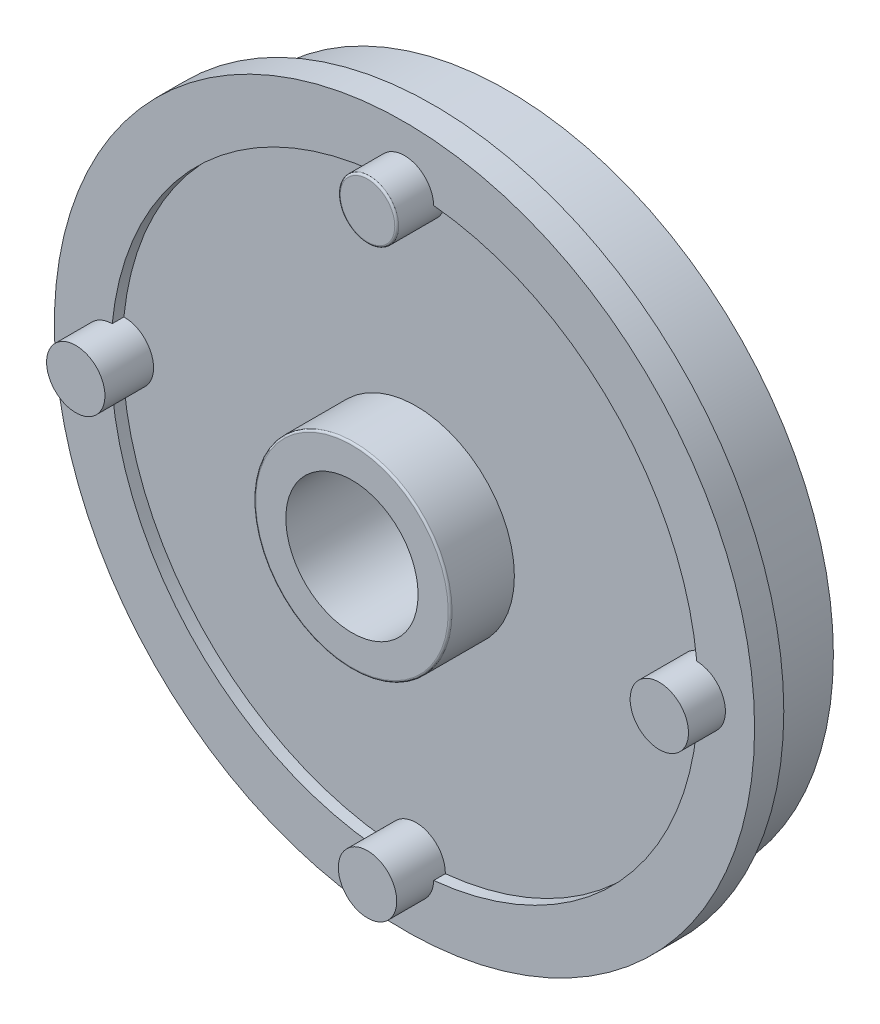
ISO-10303-21;
HEADER;
FILE_DESCRIPTION(('STEP AP214'),'2;1');
FILE_NAME('part.step','',(''),(''),'','','');
FILE_SCHEMA(('AUTOMOTIVE_DESIGN { 1 0 10303 214 1 1 1 1 }'));
ENDSEC;
DATA;
#1=APPLICATION_CONTEXT('core data for automotive mechanical design processes');
#2=APPLICATION_PROTOCOL_DEFINITION('international standard','automotive_design',2000,#1);
#3=PRODUCT_CONTEXT('',#1,'mechanical');
#4=PRODUCT('Part','Part','',(#3));
#5=PRODUCT_RELATED_PRODUCT_CATEGORY('part','',(#4));
#6=PRODUCT_DEFINITION_FORMATION('','',#4);
#7=PRODUCT_DEFINITION_CONTEXT('part definition',#1,'design');
#8=PRODUCT_DEFINITION('design','',#6,#7);
#9=PRODUCT_DEFINITION_SHAPE('','',#8);
#10=(LENGTH_UNIT() NAMED_UNIT(*) SI_UNIT(.MILLI.,.METRE.));
#11=(NAMED_UNIT(*) PLANE_ANGLE_UNIT() SI_UNIT($,.RADIAN.));
#12=(NAMED_UNIT(*) SI_UNIT($,.STERADIAN.) SOLID_ANGLE_UNIT());
#13=UNCERTAINTY_MEASURE_WITH_UNIT(LENGTH_MEASURE(1.E-05),#10,'distance_accuracy_value','');
#14=(GEOMETRIC_REPRESENTATION_CONTEXT(3) GLOBAL_UNCERTAINTY_ASSIGNED_CONTEXT((#13)) GLOBAL_UNIT_ASSIGNED_CONTEXT((#10,
#11,#12)) REPRESENTATION_CONTEXT('',''));
#15=CARTESIAN_POINT('',(0.,0.,0.));
#16=DIRECTION('',(0.,0.,1.));
#17=DIRECTION('',(1.,0.,0.));
#18=AXIS2_PLACEMENT_3D('',#15,#16,#17);
#19=CARTESIAN_POINT('',(0.,0.,4.7));
#20=DIRECTION('',(0.,0.,1.));
#21=DIRECTION('',(1.,0.,0.));
#22=AXIS2_PLACEMENT_3D('',#19,#20,#21);
#23=CYLINDRICAL_SURFACE('',#22,15.1);
#24=DIRECTION('',(0.,0.,-1.));
#25=VECTOR('',#24,1.);
#26=CARTESIAN_POINT('',(15.0253333333333,1.49978605881729,5.95));
#27=LINE('',#26,#25);
#28=CARTESIAN_POINT('',(15.0253333333333,1.49978605881729,5.3));
#29=VERTEX_POINT('',#28);
#30=CARTESIAN_POINT('',(15.0253333333333,1.49978605881729,4.7));
#31=VERTEX_POINT('',#30);
#32=EDGE_CURVE('E51',#29,#31,#27,.T.);
#33=ORIENTED_EDGE('',*,*,#32,.F.);
#34=CARTESIAN_POINT('',(0.,0.,5.3));
#35=DIRECTION('',(0.,0.,1.));
#36=DIRECTION('',(1.,0.,0.));
#37=AXIS2_PLACEMENT_3D('',#34,#35,#36);
#38=CIRCLE('',#37,15.1);
#39=CARTESIAN_POINT('',(1.49978605881713,15.0253333333333,5.3));
#40=VERTEX_POINT('',#39);
#41=EDGE_CURVE('E129',#29,#40,#38,.T.);
#42=ORIENTED_EDGE('',*,*,#41,.T.);
#43=DIRECTION('',(0.,0.,-1.));
#44=VECTOR('',#43,1.);
#45=CARTESIAN_POINT('',(1.49978605881713,15.0253333333333,5.95));
#46=LINE('',#45,#44);
#47=CARTESIAN_POINT('',(1.49978605881713,15.0253333333333,4.7));
#48=VERTEX_POINT('',#47);
#49=EDGE_CURVE('E210',#48,#40,#46,.F.);
#50=ORIENTED_EDGE('',*,*,#49,.F.);
#51=CARTESIAN_POINT('',(0.,0.,4.7));
#52=DIRECTION('',(0.,0.,1.));
#53=DIRECTION('',(1.,0.,0.));
#54=AXIS2_PLACEMENT_3D('',#51,#52,#53);
#55=CIRCLE('',#54,15.1);
#56=EDGE_CURVE('E116',#31,#48,#55,.T.);
#57=ORIENTED_EDGE('',*,*,#56,.F.);
#58=EDGE_LOOP('',(#33,#42,#50,#57));
#59=FACE_BOUND('',#58,.T.);
#60=ADVANCED_FACE('F36',(#59),#23,.F.);
#61=DIRECTION('',(0.,0.,-1.));
#62=VECTOR('',#61,1.);
#63=CARTESIAN_POINT('',(15.0253333333333,-1.49978605881697,5.95));
#64=LINE('',#63,#62);
#65=CARTESIAN_POINT('',(15.0253333333333,-1.49978605881697,4.7));
#66=VERTEX_POINT('',#65);
#67=CARTESIAN_POINT('',(15.0253333333333,-1.49978605881698,5.3));
#68=VERTEX_POINT('',#67);
#69=EDGE_CURVE('E99',#66,#68,#64,.F.);
#70=ORIENTED_EDGE('',*,*,#69,.F.);
#71=CARTESIAN_POINT('',(1.49978605881714,-15.0253333333333,4.7));
#72=VERTEX_POINT('',#71);
#73=EDGE_CURVE('E108',#72,#66,#55,.T.);
#74=ORIENTED_EDGE('',*,*,#73,.F.);
#75=DIRECTION('',(0.,0.,-1.));
#76=VECTOR('',#75,1.);
#77=CARTESIAN_POINT('',(1.49978605881713,-15.0253333333333,5.95));
#78=LINE('',#77,#76);
#79=CARTESIAN_POINT('',(1.49978605881714,-15.0253333333333,5.3));
#80=VERTEX_POINT('',#79);
#81=EDGE_CURVE('E58',#80,#72,#78,.T.);
#82=ORIENTED_EDGE('',*,*,#81,.F.);
#83=EDGE_CURVE('E110',#80,#68,#38,.T.);
#84=ORIENTED_EDGE('',*,*,#83,.T.);
#85=EDGE_LOOP('',(#70,#74,#82,#84));
#86=FACE_BOUND('',#85,.T.);
#87=ADVANCED_FACE('F107',(#86),#23,.F.);
#88=DIRECTION('',(0.,0.,-1.));
#89=VECTOR('',#88,1.);
#90=CARTESIAN_POINT('',(-1.49978605881713,-15.0253333333333,5.95));
#91=LINE('',#90,#89);
#92=CARTESIAN_POINT('',(-1.49978605881713,-15.0253333333333,4.7));
#93=VERTEX_POINT('',#92);
#94=CARTESIAN_POINT('',(-1.49978605881714,-15.0253333333333,5.3));
#95=VERTEX_POINT('',#94);
#96=EDGE_CURVE('E192',#93,#95,#91,.F.);
#97=ORIENTED_EDGE('',*,*,#96,.F.);
#98=CARTESIAN_POINT('',(-15.0253333333333,-1.49978605881719,4.7));
#99=VERTEX_POINT('',#98);
#100=EDGE_CURVE('E115',#99,#93,#55,.T.);
#101=ORIENTED_EDGE('',*,*,#100,.F.);
#102=DIRECTION('',(0.,0.,-1.));
#103=VECTOR('',#102,1.);
#104=CARTESIAN_POINT('',(-15.0253333333333,-1.49978605881718,5.95));
#105=LINE('',#104,#103);
#106=CARTESIAN_POINT('',(-15.0253333333333,-1.49978605881719,5.3));
#107=VERTEX_POINT('',#106);
#108=EDGE_CURVE('E190',#107,#99,#105,.T.);
#109=ORIENTED_EDGE('',*,*,#108,.F.);
#110=EDGE_CURVE('E128',#107,#95,#38,.T.);
#111=ORIENTED_EDGE('',*,*,#110,.T.);
#112=EDGE_LOOP('',(#97,#101,#109,#111));
#113=FACE_BOUND('',#112,.T.);
#114=ADVANCED_FACE('F188',(#113),#23,.F.);
#115=DIRECTION('',(0.,0.,-1.));
#116=VECTOR('',#115,1.);
#117=CARTESIAN_POINT('',(-15.0253333333333,1.49978605881708,5.95));
#118=LINE('',#117,#116);
#119=CARTESIAN_POINT('',(-15.0253333333333,1.49978605881708,4.7));
#120=VERTEX_POINT('',#119);
#121=CARTESIAN_POINT('',(-15.0253333333333,1.49978605881709,5.3));
#122=VERTEX_POINT('',#121);
#123=EDGE_CURVE('E207',#120,#122,#118,.F.);
#124=ORIENTED_EDGE('',*,*,#123,.F.);
#125=CARTESIAN_POINT('',(-1.49978605881714,15.0253333333333,4.7));
#126=VERTEX_POINT('',#125);
#127=EDGE_CURVE('E118',#126,#120,#55,.T.);
#128=ORIENTED_EDGE('',*,*,#127,.F.);
#129=DIRECTION('',(0.,0.,-1.));
#130=VECTOR('',#129,1.);
#131=CARTESIAN_POINT('',(-1.49978605881713,15.0253333333333,5.95));
#132=LINE('',#131,#130);
#133=CARTESIAN_POINT('',(-1.49978605881714,15.0253333333333,5.3));
#134=VERTEX_POINT('',#133);
#135=EDGE_CURVE('E216',#134,#126,#132,.T.);
#136=ORIENTED_EDGE('',*,*,#135,.F.);
#137=EDGE_CURVE('E119',#134,#122,#38,.T.);
#138=ORIENTED_EDGE('',*,*,#137,.T.);
#139=EDGE_LOOP('',(#124,#128,#136,#138));
#140=FACE_BOUND('',#139,.T.);
#141=ADVANCED_FACE('F240',(#140),#23,.F.);
#142=CARTESIAN_POINT('',(0.,0.,8.));
#143=DIRECTION('',(0.,0.,-1.));
#144=DIRECTION('',(-1.,0.,0.));
#145=AXIS2_PLACEMENT_3D('',#142,#143,#144);
#146=CYLINDRICAL_SURFACE('',#145,2.65);
#147=CARTESIAN_POINT('',(0.,0.,-0.5));
#148=DIRECTION('',(0.,0.,-1.));
#149=DIRECTION('',(-1.,0.,0.));
#150=AXIS2_PLACEMENT_3D('',#147,#148,#149);
#151=CIRCLE('',#150,2.65);
#152=CARTESIAN_POINT('',(-2.65,0.,-0.5));
#153=VERTEX_POINT('',#152);
#154=EDGE_CURVE('E163',#153,#153,#151,.T.);
#155=ORIENTED_EDGE('',*,*,#154,.T.);
#156=EDGE_LOOP('',(#155));
#157=FACE_BOUND('',#156,.T.);
#158=CARTESIAN_POINT('',(0.,0.,1.));
#159=DIRECTION('',(0.,0.,1.));
#160=DIRECTION('',(1.,0.,0.));
#161=AXIS2_PLACEMENT_3D('',#158,#159,#160);
#162=CIRCLE('',#161,2.65);
#163=CARTESIAN_POINT('',(2.65,0.,1.));
#164=VERTEX_POINT('',#163);
#165=EDGE_CURVE('E160',#164,#164,#162,.F.);
#166=ORIENTED_EDGE('',*,*,#165,.F.);
#167=EDGE_LOOP('',(#166));
#168=FACE_BOUND('',#167,.T.);
#169=ADVANCED_FACE('F265',(#157,#168),#146,.F.);
#170=CARTESIAN_POINT('',(0.,0.,3.8));
#171=DIRECTION('',(0.,0.,-1.));
#172=DIRECTION('',(-1.,0.,0.));
#173=AXIS2_PLACEMENT_3D('',#170,#171,#172);
#174=CYLINDRICAL_SURFACE('',#173,16.75);
#175=CARTESIAN_POINT('',(0.,0.,3.8));
#176=DIRECTION('',(0.,0.,1.));
#177=DIRECTION('',(1.,0.,0.));
#178=AXIS2_PLACEMENT_3D('',#175,#176,#177);
#179=CIRCLE('',#178,16.75);
#180=CARTESIAN_POINT('',(16.75,0.,3.8));
#181=VERTEX_POINT('',#180);
#182=EDGE_CURVE('E154',#181,#181,#179,.T.);
#183=ORIENTED_EDGE('',*,*,#182,.F.);
#184=EDGE_LOOP('',(#183));
#185=FACE_BOUND('',#184,.T.);
#186=CARTESIAN_POINT('',(0.,0.,0.));
#187=DIRECTION('',(0.,0.,1.));
#188=DIRECTION('',(1.,0.,0.));
#189=AXIS2_PLACEMENT_3D('',#186,#187,#188);
#190=CIRCLE('',#189,16.75);
#191=CARTESIAN_POINT('',(16.75,0.,0.));
#192=VERTEX_POINT('',#191);
#193=EDGE_CURVE('E151',#192,#192,#190,.T.);
#194=ORIENTED_EDGE('',*,*,#193,.T.);
#195=EDGE_LOOP('',(#194));
#196=FACE_BOUND('',#195,.T.);
#197=ADVANCED_FACE('F270',(#185,#196),#174,.T.);
#198=CARTESIAN_POINT('',(0.,0.,0.));
#199=DIRECTION('',(0.,0.,1.));
#200=DIRECTION('',(1.,0.,0.));
#201=AXIS2_PLACEMENT_3D('',#198,#199,#200);
#202=PLANE('',#201);
#203=CARTESIAN_POINT('',(0.,0.,0.));
#204=DIRECTION('',(0.,0.,-1.));
#205=DIRECTION('',(-1.,0.,0.));
#206=AXIS2_PLACEMENT_3D('',#203,#204,#205);
#207=CIRCLE('',#206,13.25);
#208=CARTESIAN_POINT('',(-13.25,0.,0.));
#209=VERTEX_POINT('',#208);
#210=EDGE_CURVE('E139',#209,#209,#207,.T.);
#211=ORIENTED_EDGE('',*,*,#210,.F.);
#212=EDGE_LOOP('',(#211));
#213=FACE_BOUND('',#212,.T.);
#214=ORIENTED_EDGE('',*,*,#193,.F.);
#215=EDGE_LOOP('',(#214));
#216=FACE_BOUND('',#215,.T.);
#217=ADVANCED_FACE('F432',(#213,#216),#202,.F.);
#218=CARTESIAN_POINT('',(0.,0.,5.3));
#219=DIRECTION('',(0.,0.,-1.));
#220=DIRECTION('',(-1.,0.,0.));
#221=AXIS2_PLACEMENT_3D('',#218,#219,#220);
#222=CYLINDRICAL_SURFACE('',#221,18.);
#223=CARTESIAN_POINT('',(0.,0.,5.3));
#224=DIRECTION('',(0.,0.,1.));
#225=DIRECTION('',(1.,0.,0.));
#226=AXIS2_PLACEMENT_3D('',#223,#224,#225);
#227=CIRCLE('',#226,18.);
#228=CARTESIAN_POINT('',(18.,0.,5.3));
#229=VERTEX_POINT('',#228);
#230=EDGE_CURVE('E148',#229,#229,#227,.T.);
#231=ORIENTED_EDGE('',*,*,#230,.F.);
#232=EDGE_LOOP('',(#231));
#233=FACE_BOUND('',#232,.T.);
#234=CARTESIAN_POINT('',(0.,0.,3.8));
#235=DIRECTION('',(0.,0.,1.));
#236=DIRECTION('',(1.,0.,0.));
#237=AXIS2_PLACEMENT_3D('',#234,#235,#236);
#238=CIRCLE('',#237,18.);
#239=CARTESIAN_POINT('',(18.,0.,3.8));
#240=VERTEX_POINT('',#239);
#241=EDGE_CURVE('E145',#240,#240,#238,.T.);
#242=ORIENTED_EDGE('',*,*,#241,.T.);
#243=EDGE_LOOP('',(#242));
#244=FACE_BOUND('',#243,.T.);
#245=ADVANCED_FACE('F437',(#233,#244),#222,.T.);
#246=CARTESIAN_POINT('',(0.,0.,5.3));
#247=DIRECTION('',(0.,0.,1.));
#248=DIRECTION('',(1.,0.,0.));
#249=AXIS2_PLACEMENT_3D('',#246,#247,#248);
#250=PLANE('',#249);
#251=ORIENTED_EDGE('',*,*,#41,.F.);
#252=CARTESIAN_POINT('',(15.,1.57116660247941E-13,5.3));
#253=DIRECTION('',(0.,0.,1.));
#254=DIRECTION('',(1.,0.,0.));
#255=AXIS2_PLACEMENT_3D('',#252,#253,#254);
#256=CIRCLE('',#255,1.5);
#257=EDGE_CURVE('E111',#29,#68,#256,.F.);
#258=ORIENTED_EDGE('',*,*,#257,.T.);
#259=ORIENTED_EDGE('',*,*,#83,.F.);
#260=CARTESIAN_POINT('',(0.,-15.,5.3));
#261=DIRECTION('',(0.,0.,1.));
#262=DIRECTION('',(1.,0.,0.));
#263=AXIS2_PLACEMENT_3D('',#260,#261,#262);
#264=CIRCLE('',#263,1.5);
#265=EDGE_CURVE('E194',#80,#95,#264,.F.);
#266=ORIENTED_EDGE('',*,*,#265,.T.);
#267=ORIENTED_EDGE('',*,*,#110,.F.);
#268=CARTESIAN_POINT('',(-15.,0.,5.3));
#269=DIRECTION('',(0.,0.,1.));
#270=DIRECTION('',(1.,0.,0.));
#271=AXIS2_PLACEMENT_3D('',#268,#269,#270);
#272=CIRCLE('',#271,1.5);
#273=EDGE_CURVE('E204',#107,#122,#272,.F.);
#274=ORIENTED_EDGE('',*,*,#273,.T.);
#275=ORIENTED_EDGE('',*,*,#137,.F.);
#276=CARTESIAN_POINT('',(0.,15.,5.3));
#277=DIRECTION('',(0.,0.,1.));
#278=DIRECTION('',(1.,0.,0.));
#279=AXIS2_PLACEMENT_3D('',#276,#277,#278);
#280=CIRCLE('',#279,1.5);
#281=EDGE_CURVE('E213',#134,#40,#280,.F.);
#282=ORIENTED_EDGE('',*,*,#281,.T.);
#283=EDGE_LOOP('',(#251,#258,#259,#266,#267,#274,#275,#282));
#284=FACE_BOUND('',#283,.T.);
#285=ORIENTED_EDGE('',*,*,#230,.T.);
#286=EDGE_LOOP('',(#285));
#287=FACE_BOUND('',#286,.T.);
#288=ADVANCED_FACE('F237',(#284,#287),#250,.T.);
#289=CARTESIAN_POINT('',(0.,0.,3.8));
#290=DIRECTION('',(0.,0.,1.));
#291=DIRECTION('',(1.,0.,0.));
#292=AXIS2_PLACEMENT_3D('',#289,#290,#291);
#293=PLANE('',#292);
#294=ORIENTED_EDGE('',*,*,#182,.T.);
#295=EDGE_LOOP('',(#294));
#296=FACE_BOUND('',#295,.T.);
#297=ORIENTED_EDGE('',*,*,#241,.F.);
#298=EDGE_LOOP('',(#297));
#299=FACE_BOUND('',#298,.T.);
#300=ADVANCED_FACE('F424',(#296,#299),#293,.F.);
#301=CARTESIAN_POINT('',(0.,0.,4.));
#302=DIRECTION('',(0.,0.,-1.));
#303=DIRECTION('',(-1.,0.,0.));
#304=AXIS2_PLACEMENT_3D('',#301,#302,#303);
#305=CYLINDRICAL_SURFACE('',#304,13.25);
#306=CARTESIAN_POINT('',(0.,0.,4.));
#307=DIRECTION('',(0.,0.,-1.));
#308=DIRECTION('',(-1.,0.,0.));
#309=AXIS2_PLACEMENT_3D('',#306,#307,#308);
#310=CIRCLE('',#309,13.25);
#311=CARTESIAN_POINT('',(-13.25,0.,4.));
#312=VERTEX_POINT('',#311);
#313=EDGE_CURVE('E142',#312,#312,#310,.T.);
#314=ORIENTED_EDGE('',*,*,#313,.F.);
#315=EDGE_LOOP('',(#314));
#316=FACE_BOUND('',#315,.T.);
#317=ORIENTED_EDGE('',*,*,#210,.T.);
#318=EDGE_LOOP('',(#317));
#319=FACE_BOUND('',#318,.T.);
#320=ADVANCED_FACE('F414',(#316,#319),#305,.F.);
#321=CARTESIAN_POINT('',(0.,0.,4.));
#322=DIRECTION('',(0.,0.,-1.));
#323=DIRECTION('',(-1.,0.,0.));
#324=AXIS2_PLACEMENT_3D('',#321,#322,#323);
#325=PLANE('',#324);
#326=CARTESIAN_POINT('',(0.,0.,4.));
#327=DIRECTION('',(0.,0.,-1.));
#328=DIRECTION('',(-1.,0.,0.));
#329=AXIS2_PLACEMENT_3D('',#326,#327,#328);
#330=CIRCLE('',#329,5.);
#331=CARTESIAN_POINT('',(-5.,0.,4.));
#332=VERTEX_POINT('',#331);
#333=EDGE_CURVE('E133',#332,#332,#330,.T.);
#334=ORIENTED_EDGE('',*,*,#333,.F.);
#335=EDGE_LOOP('',(#334));
#336=FACE_BOUND('',#335,.T.);
#337=ORIENTED_EDGE('',*,*,#313,.T.);
#338=EDGE_LOOP('',(#337));
#339=FACE_BOUND('',#338,.T.);
#340=ADVANCED_FACE('F404',(#336,#339),#325,.T.);
#341=CARTESIAN_POINT('',(0.,0.,-2.5));
#342=DIRECTION('',(0.,0.,1.));
#343=DIRECTION('',(1.,0.,0.));
#344=AXIS2_PLACEMENT_3D('',#341,#342,#343);
#345=CYLINDRICAL_SURFACE('',#344,5.);
#346=CARTESIAN_POINT('',(0.,0.,-2.5));
#347=DIRECTION('',(0.,0.,-1.));
#348=DIRECTION('',(-1.,0.,0.));
#349=AXIS2_PLACEMENT_3D('',#346,#347,#348);
#350=CIRCLE('',#349,5.);
#351=CARTESIAN_POINT('',(-5.,0.,-2.5));
#352=VERTEX_POINT('',#351);
#353=EDGE_CURVE('E136',#352,#352,#350,.T.);
#354=ORIENTED_EDGE('',*,*,#353,.F.);
#355=EDGE_LOOP('',(#354));
#356=FACE_BOUND('',#355,.T.);
#357=ORIENTED_EDGE('',*,*,#333,.T.);
#358=EDGE_LOOP('',(#357));
#359=FACE_BOUND('',#358,.T.);
#360=ADVANCED_FACE('F394',(#356,#359),#345,.T.);
#361=CARTESIAN_POINT('',(0.,0.,-2.5));
#362=DIRECTION('',(0.,0.,-1.));
#363=DIRECTION('',(-1.,0.,0.));
#364=AXIS2_PLACEMENT_3D('',#361,#362,#363);
#365=PLANE('',#364);
#366=CARTESIAN_POINT('',(0.,0.,-2.5));
#367=DIRECTION('',(0.,0.,-1.));
#368=DIRECTION('',(-1.,0.,0.));
#369=AXIS2_PLACEMENT_3D('',#366,#367,#368);
#370=CIRCLE('',#369,4.);
#371=CARTESIAN_POINT('',(-4.,0.,-2.5));
#372=VERTEX_POINT('',#371);
#373=EDGE_CURVE('E123',#372,#372,#370,.T.);
#374=ORIENTED_EDGE('',*,*,#373,.F.);
#375=EDGE_LOOP('',(#374));
#376=FACE_BOUND('',#375,.T.);
#377=ORIENTED_EDGE('',*,*,#353,.T.);
#378=EDGE_LOOP('',(#377));
#379=FACE_BOUND('',#378,.T.);
#380=ADVANCED_FACE('F384',(#376,#379),#365,.T.);
#381=CARTESIAN_POINT('',(0.,0.,-0.5));
#382=DIRECTION('',(0.,0.,-1.));
#383=DIRECTION('',(-1.,0.,0.));
#384=AXIS2_PLACEMENT_3D('',#381,#382,#383);
#385=CYLINDRICAL_SURFACE('',#384,4.);
#386=CARTESIAN_POINT('',(0.,0.,-0.5));
#387=DIRECTION('',(0.,0.,-1.));
#388=DIRECTION('',(-1.,0.,0.));
#389=AXIS2_PLACEMENT_3D('',#386,#387,#388);
#390=CIRCLE('',#389,4.);
#391=CARTESIAN_POINT('',(-4.,0.,-0.5));
#392=VERTEX_POINT('',#391);
#393=EDGE_CURVE('E130',#392,#392,#390,.T.);
#394=ORIENTED_EDGE('',*,*,#393,.F.);
#395=EDGE_LOOP('',(#394));
#396=FACE_BOUND('',#395,.T.);
#397=ORIENTED_EDGE('',*,*,#373,.T.);
#398=EDGE_LOOP('',(#397));
#399=FACE_BOUND('',#398,.T.);
#400=ADVANCED_FACE('F375',(#396,#399),#385,.F.);
#401=CARTESIAN_POINT('',(0.,0.,-0.5));
#402=DIRECTION('',(0.,0.,-1.));
#403=DIRECTION('',(-1.,0.,0.));
#404=AXIS2_PLACEMENT_3D('',#401,#402,#403);
#405=PLANE('',#404);
#406=ORIENTED_EDGE('',*,*,#154,.F.);
#407=EDGE_LOOP('',(#406));
#408=FACE_BOUND('',#407,.T.);
#409=ORIENTED_EDGE('',*,*,#393,.T.);
#410=EDGE_LOOP('',(#409));
#411=FACE_BOUND('',#410,.T.);
#412=ADVANCED_FACE('F370',(#408,#411),#405,.T.);
#413=CARTESIAN_POINT('',(0.,0.,4.7));
#414=DIRECTION('',(0.,0.,1.));
#415=DIRECTION('',(1.,0.,0.));
#416=AXIS2_PLACEMENT_3D('',#413,#414,#415);
#417=PLANE('',#416);
#418=CARTESIAN_POINT('',(0.,0.,4.7));
#419=DIRECTION('',(0.,0.,1.));
#420=DIRECTION('',(1.,0.,0.));
#421=AXIS2_PLACEMENT_3D('',#418,#419,#420);
#422=CIRCLE('',#421,5.05);
#423=CARTESIAN_POINT('',(5.05,0.,4.7));
#424=VERTEX_POINT('',#423);
#425=EDGE_CURVE('E124',#424,#424,#422,.T.);
#426=ORIENTED_EDGE('',*,*,#425,.F.);
#427=EDGE_LOOP('',(#426));
#428=FACE_BOUND('',#427,.T.);
#429=ORIENTED_EDGE('',*,*,#73,.T.);
#430=CARTESIAN_POINT('',(15.,1.57116660247941E-13,4.7));
#431=DIRECTION('',(0.,0.,1.));
#432=DIRECTION('',(1.,0.,0.));
#433=AXIS2_PLACEMENT_3D('',#430,#431,#432);
#434=CIRCLE('',#433,1.5);
#435=EDGE_CURVE('E11',#66,#31,#434,.F.);
#436=ORIENTED_EDGE('',*,*,#435,.T.);
#437=ORIENTED_EDGE('',*,*,#56,.T.);
#438=CARTESIAN_POINT('',(0.,15.,4.7));
#439=DIRECTION('',(0.,0.,1.));
#440=DIRECTION('',(1.,0.,0.));
#441=AXIS2_PLACEMENT_3D('',#438,#439,#440);
#442=CIRCLE('',#441,1.5);
#443=EDGE_CURVE('E157',#48,#126,#442,.F.);
#444=ORIENTED_EDGE('',*,*,#443,.T.);
#445=ORIENTED_EDGE('',*,*,#127,.T.);
#446=CARTESIAN_POINT('',(-15.,0.,4.7));
#447=DIRECTION('',(0.,0.,1.));
#448=DIRECTION('',(1.,0.,0.));
#449=AXIS2_PLACEMENT_3D('',#446,#447,#448);
#450=CIRCLE('',#449,1.5);
#451=EDGE_CURVE('E179',#120,#99,#450,.F.);
#452=ORIENTED_EDGE('',*,*,#451,.T.);
#453=ORIENTED_EDGE('',*,*,#100,.T.);
#454=CARTESIAN_POINT('',(0.,-15.,4.7));
#455=DIRECTION('',(0.,0.,1.));
#456=DIRECTION('',(1.,0.,0.));
#457=AXIS2_PLACEMENT_3D('',#454,#455,#456);
#458=CIRCLE('',#457,1.5);
#459=EDGE_CURVE('E44',#93,#72,#458,.F.);
#460=ORIENTED_EDGE('',*,*,#459,.T.);
#461=EDGE_LOOP('',(#429,#436,#437,#444,#445,#452,#453,#460));
#462=FACE_BOUND('',#461,.T.);
#463=ADVANCED_FACE('F113',(#428,#462),#417,.T.);
#464=CARTESIAN_POINT('',(0.,0.,8.));
#465=DIRECTION('',(0.,0.,-1.));
#466=DIRECTION('',(-1.,0.,0.));
#467=AXIS2_PLACEMENT_3D('',#464,#465,#466);
#468=CYLINDRICAL_SURFACE('',#467,5.05);
#469=CARTESIAN_POINT('',(0.,0.,7.9));
#470=DIRECTION('',(0.,0.,1.));
#471=DIRECTION('',(1.,0.,0.));
#472=AXIS2_PLACEMENT_3D('',#469,#470,#471);
#473=CIRCLE('',#472,5.05);
#474=CARTESIAN_POINT('',(5.05,0.,7.9));
#475=VERTEX_POINT('',#474);
#476=EDGE_CURVE('E176',#475,#475,#473,.F.);
#477=ORIENTED_EDGE('',*,*,#476,.T.);
#478=EDGE_LOOP('',(#477));
#479=FACE_BOUND('',#478,.T.);
#480=ORIENTED_EDGE('',*,*,#425,.T.);
#481=EDGE_LOOP('',(#480));
#482=FACE_BOUND('',#481,.T.);
#483=ADVANCED_FACE('F303',(#479,#482),#468,.T.);
#484=CARTESIAN_POINT('',(0.,0.,8.));
#485=DIRECTION('',(0.,0.,1.));
#486=DIRECTION('',(1.,0.,0.));
#487=AXIS2_PLACEMENT_3D('',#484,#485,#486);
#488=PLANE('',#487);
#489=CARTESIAN_POINT('',(0.,0.,8.));
#490=DIRECTION('',(0.,0.,1.));
#491=DIRECTION('',(1.,0.,0.));
#492=AXIS2_PLACEMENT_3D('',#489,#490,#491);
#493=CIRCLE('',#492,4.95);
#494=CARTESIAN_POINT('',(4.95,0.,8.));
#495=VERTEX_POINT('',#494);
#496=EDGE_CURVE('E173',#495,#495,#493,.T.);
#497=ORIENTED_EDGE('',*,*,#496,.T.);
#498=EDGE_LOOP('',(#497));
#499=FACE_BOUND('',#498,.T.);
#500=CARTESIAN_POINT('',(0.,0.,8.));
#501=DIRECTION('',(0.,0.,1.));
#502=DIRECTION('',(1.,0.,0.));
#503=AXIS2_PLACEMENT_3D('',#500,#501,#502);
#504=CIRCLE('',#503,3.4);
#505=CARTESIAN_POINT('',(3.4,0.,8.));
#506=VERTEX_POINT('',#505);
#507=EDGE_CURVE('E218',#506,#506,#504,.T.);
#508=ORIENTED_EDGE('',*,*,#507,.F.);
#509=EDGE_LOOP('',(#508));
#510=FACE_BOUND('',#509,.T.);
#511=ADVANCED_FACE('F297',(#499,#510),#488,.T.);
#512=CARTESIAN_POINT('',(0.,0.,1.));
#513=DIRECTION('',(0.,0.,1.));
#514=DIRECTION('',(1.,0.,0.));
#515=AXIS2_PLACEMENT_3D('',#512,#513,#514);
#516=PLANE('',#515);
#517=CARTESIAN_POINT('',(0.,0.,1.));
#518=DIRECTION('',(0.,0.,1.));
#519=DIRECTION('',(1.,0.,0.));
#520=AXIS2_PLACEMENT_3D('',#517,#518,#519);
#521=CIRCLE('',#520,3.4);
#522=CARTESIAN_POINT('',(3.4,0.,1.));
#523=VERTEX_POINT('',#522);
#524=EDGE_CURVE('E164',#523,#523,#521,.T.);
#525=ORIENTED_EDGE('',*,*,#524,.T.);
#526=EDGE_LOOP('',(#525));
#527=FACE_BOUND('',#526,.T.);
#528=ORIENTED_EDGE('',*,*,#165,.T.);
#529=EDGE_LOOP('',(#528));
#530=FACE_BOUND('',#529,.T.);
#531=ADVANCED_FACE('F302',(#527,#530),#516,.T.);
#532=CARTESIAN_POINT('',(0.,0.,1.));
#533=DIRECTION('',(0.,0.,1.));
#534=DIRECTION('',(1.,0.,0.));
#535=AXIS2_PLACEMENT_3D('',#532,#533,#534);
#536=CYLINDRICAL_SURFACE('',#535,3.4);
#537=ORIENTED_EDGE('',*,*,#524,.F.);
#538=EDGE_LOOP('',(#537));
#539=FACE_BOUND('',#538,.T.);
#540=ORIENTED_EDGE('',*,*,#507,.T.);
#541=EDGE_LOOP('',(#540));
#542=FACE_BOUND('',#541,.T.);
#543=ADVANCED_FACE('F341',(#539,#542),#536,.F.);
#544=CARTESIAN_POINT('',(0.,15.,7.2));
#545=DIRECTION('',(0.,0.,-1.));
#546=DIRECTION('',(-1.,0.,0.));
#547=AXIS2_PLACEMENT_3D('',#544,#545,#546);
#548=CYLINDRICAL_SURFACE('',#547,1.5);
#549=CARTESIAN_POINT('',(0.,15.,7.1));
#550=DIRECTION('',(0.,0.,1.));
#551=DIRECTION('',(1.,0.,0.));
#552=AXIS2_PLACEMENT_3D('',#549,#550,#551);
#553=CIRCLE('',#552,1.5);
#554=CARTESIAN_POINT('',(1.5,15.,7.1));
#555=VERTEX_POINT('',#554);
#556=EDGE_CURVE('E170',#555,#555,#553,.F.);
#557=ORIENTED_EDGE('',*,*,#556,.T.);
#558=EDGE_LOOP('',(#557));
#559=FACE_BOUND('',#558,.T.);
#560=ORIENTED_EDGE('',*,*,#281,.F.);
#561=ORIENTED_EDGE('',*,*,#135,.T.);
#562=ORIENTED_EDGE('',*,*,#443,.F.);
#563=ORIENTED_EDGE('',*,*,#49,.T.);
#564=EDGE_LOOP('',(#560,#561,#562,#563));
#565=FACE_BOUND('',#564,.T.);
#566=ADVANCED_FACE('F234',(#559,#565),#548,.T.);
#567=CARTESIAN_POINT('',(0.,15.,7.2));
#568=DIRECTION('',(0.,0.,1.));
#569=DIRECTION('',(1.,0.,0.));
#570=AXIS2_PLACEMENT_3D('',#567,#568,#569);
#571=PLANE('',#570);
#572=CARTESIAN_POINT('',(0.,15.,7.2));
#573=DIRECTION('',(0.,0.,1.));
#574=DIRECTION('',(1.,0.,0.));
#575=AXIS2_PLACEMENT_3D('',#572,#573,#574);
#576=CIRCLE('',#575,1.4);
#577=CARTESIAN_POINT('',(1.4,15.,7.2));
#578=VERTEX_POINT('',#577);
#579=EDGE_CURVE('E167',#578,#578,#576,.T.);
#580=ORIENTED_EDGE('',*,*,#579,.T.);
#581=EDGE_LOOP('',(#580));
#582=FACE_BOUND('',#581,.T.);
#583=ADVANCED_FACE('F324',(#582),#571,.T.);
#584=CARTESIAN_POINT('',(0.,15.,7.1));
#585=DIRECTION('',(0.,0.,1.));
#586=DIRECTION('',(1.,0.,0.));
#587=AXIS2_PLACEMENT_3D('',#584,#585,#586);
#588=TOROIDAL_SURFACE('',#587,1.4,0.1);
#589=ORIENTED_EDGE('',*,*,#556,.F.);
#590=EDGE_LOOP('',(#589));
#591=FACE_BOUND('',#590,.T.);
#592=ORIENTED_EDGE('',*,*,#579,.F.);
#593=EDGE_LOOP('',(#592));
#594=FACE_BOUND('',#593,.T.);
#595=ADVANCED_FACE('F253',(#591,#594),#588,.T.);
#596=CARTESIAN_POINT('',(0.,0.,7.9));
#597=DIRECTION('',(0.,0.,1.));
#598=DIRECTION('',(1.,0.,0.));
#599=AXIS2_PLACEMENT_3D('',#596,#597,#598);
#600=TOROIDAL_SURFACE('',#599,4.95,0.1);
#601=ORIENTED_EDGE('',*,*,#476,.F.);
#602=EDGE_LOOP('',(#601));
#603=FACE_BOUND('',#602,.T.);
#604=ORIENTED_EDGE('',*,*,#496,.F.);
#605=EDGE_LOOP('',(#604));
#606=FACE_BOUND('',#605,.T.);
#607=ADVANCED_FACE('F38',(#603,#606),#600,.T.);
#608=CARTESIAN_POINT('',(-15.,0.,7.2));
#609=DIRECTION('',(0.,0.,-1.));
#610=DIRECTION('',(-1.,0.,0.));
#611=AXIS2_PLACEMENT_3D('',#608,#609,#610);
#612=CYLINDRICAL_SURFACE('',#611,1.5);
#613=CARTESIAN_POINT('',(-15.,0.,7.2));
#614=DIRECTION('',(0.,0.,1.));
#615=DIRECTION('',(0.,1.,0.));
#616=AXIS2_PLACEMENT_3D('',#613,#614,#615);
#617=CIRCLE('',#616,1.5);
#618=CARTESIAN_POINT('',(-15.,1.49999999999995,7.2));
#619=VERTEX_POINT('',#618);
#620=EDGE_CURVE('E196',#619,#619,#617,.T.);
#621=ORIENTED_EDGE('',*,*,#620,.F.);
#622=EDGE_LOOP('',(#621));
#623=FACE_BOUND('',#622,.T.);
#624=ORIENTED_EDGE('',*,*,#273,.F.);
#625=ORIENTED_EDGE('',*,*,#108,.T.);
#626=ORIENTED_EDGE('',*,*,#451,.F.);
#627=ORIENTED_EDGE('',*,*,#123,.T.);
#628=EDGE_LOOP('',(#624,#625,#626,#627));
#629=FACE_BOUND('',#628,.T.);
#630=ADVANCED_FACE('F241',(#623,#629),#612,.T.);
#631=CARTESIAN_POINT('',(-15.,0.,7.2));
#632=DIRECTION('',(0.,0.,1.));
#633=DIRECTION('',(0.,1.,0.));
#634=AXIS2_PLACEMENT_3D('',#631,#632,#633);
#635=PLANE('',#634);
#636=ORIENTED_EDGE('',*,*,#620,.T.);
#637=EDGE_LOOP('',(#636));
#638=FACE_BOUND('',#637,.T.);
#639=ADVANCED_FACE('F243',(#638),#635,.T.);
#640=CARTESIAN_POINT('',(0.,-15.,7.2));
#641=DIRECTION('',(0.,0.,-1.));
#642=DIRECTION('',(-1.,0.,0.));
#643=AXIS2_PLACEMENT_3D('',#640,#641,#642);
#644=CYLINDRICAL_SURFACE('',#643,1.5);
#645=CARTESIAN_POINT('',(0.,-15.,7.2));
#646=DIRECTION('',(0.,0.,1.));
#647=DIRECTION('',(-1.,0.,0.));
#648=AXIS2_PLACEMENT_3D('',#645,#646,#647);
#649=CIRCLE('',#648,1.5);
#650=CARTESIAN_POINT('',(-1.5,-15.,7.2));
#651=VERTEX_POINT('',#650);
#652=EDGE_CURVE('E198',#651,#651,#649,.T.);
#653=ORIENTED_EDGE('',*,*,#652,.F.);
#654=EDGE_LOOP('',(#653));
#655=FACE_BOUND('',#654,.T.);
#656=ORIENTED_EDGE('',*,*,#265,.F.);
#657=ORIENTED_EDGE('',*,*,#81,.T.);
#658=ORIENTED_EDGE('',*,*,#459,.F.);
#659=ORIENTED_EDGE('',*,*,#96,.T.);
#660=EDGE_LOOP('',(#656,#657,#658,#659));
#661=FACE_BOUND('',#660,.T.);
#662=ADVANCED_FACE('F250',(#655,#661),#644,.T.);
#663=CARTESIAN_POINT('',(0.,-15.,7.2));
#664=DIRECTION('',(0.,0.,1.));
#665=DIRECTION('',(-1.,0.,0.));
#666=AXIS2_PLACEMENT_3D('',#663,#664,#665);
#667=PLANE('',#666);
#668=ORIENTED_EDGE('',*,*,#652,.T.);
#669=EDGE_LOOP('',(#668));
#670=FACE_BOUND('',#669,.T.);
#671=ADVANCED_FACE('F497',(#670),#667,.T.);
#672=CARTESIAN_POINT('',(15.,1.57116660247941E-13,7.2));
#673=DIRECTION('',(0.,0.,-1.));
#674=DIRECTION('',(-1.,0.,0.));
#675=AXIS2_PLACEMENT_3D('',#672,#673,#674);
#676=CYLINDRICAL_SURFACE('',#675,1.5);
#677=CARTESIAN_POINT('',(15.,1.57116660247941E-13,7.2));
#678=DIRECTION('',(0.,0.,1.));
#679=DIRECTION('',(0.,-1.,0.));
#680=AXIS2_PLACEMENT_3D('',#677,#678,#679);
#681=CIRCLE('',#680,1.5);
#682=CARTESIAN_POINT('',(15.,-1.49999999999984,7.2));
#683=VERTEX_POINT('',#682);
#684=EDGE_CURVE('E532',#683,#683,#681,.T.);
#685=ORIENTED_EDGE('',*,*,#684,.F.);
#686=EDGE_LOOP('',(#685));
#687=FACE_BOUND('',#686,.T.);
#688=ORIENTED_EDGE('',*,*,#257,.F.);
#689=ORIENTED_EDGE('',*,*,#32,.T.);
#690=ORIENTED_EDGE('',*,*,#435,.F.);
#691=ORIENTED_EDGE('',*,*,#69,.T.);
#692=EDGE_LOOP('',(#688,#689,#690,#691));
#693=FACE_BOUND('',#692,.T.);
#694=ADVANCED_FACE('F98',(#687,#693),#676,.T.);
#695=CARTESIAN_POINT('',(15.,1.57116660247941E-13,7.2));
#696=DIRECTION('',(0.,0.,1.));
#697=DIRECTION('',(0.,-1.,0.));
#698=AXIS2_PLACEMENT_3D('',#695,#696,#697);
#699=PLANE('',#698);
#700=ORIENTED_EDGE('',*,*,#684,.T.);
#701=EDGE_LOOP('',(#700));
#702=FACE_BOUND('',#701,.T.);
#703=ADVANCED_FACE('F516',(#702),#699,.T.);
#704=CLOSED_SHELL('',(#60,#87,#114,#141,#169,#197,#217,#245,#288,#300,#320,#340,#360,#380,#400,
#412,#463,#483,#511,#531,#543,#566,#583,#595,#607,#630,#639,#662,#671,#694,#703));
#705=MANIFOLD_SOLID_BREP('B2',#704);
#706=ADVANCED_BREP_SHAPE_REPRESENTATION('',(#18,#705),#14);
#707=SHAPE_DEFINITION_REPRESENTATION(#9,#706);
ENDSEC;
END-ISO-10303-21;
